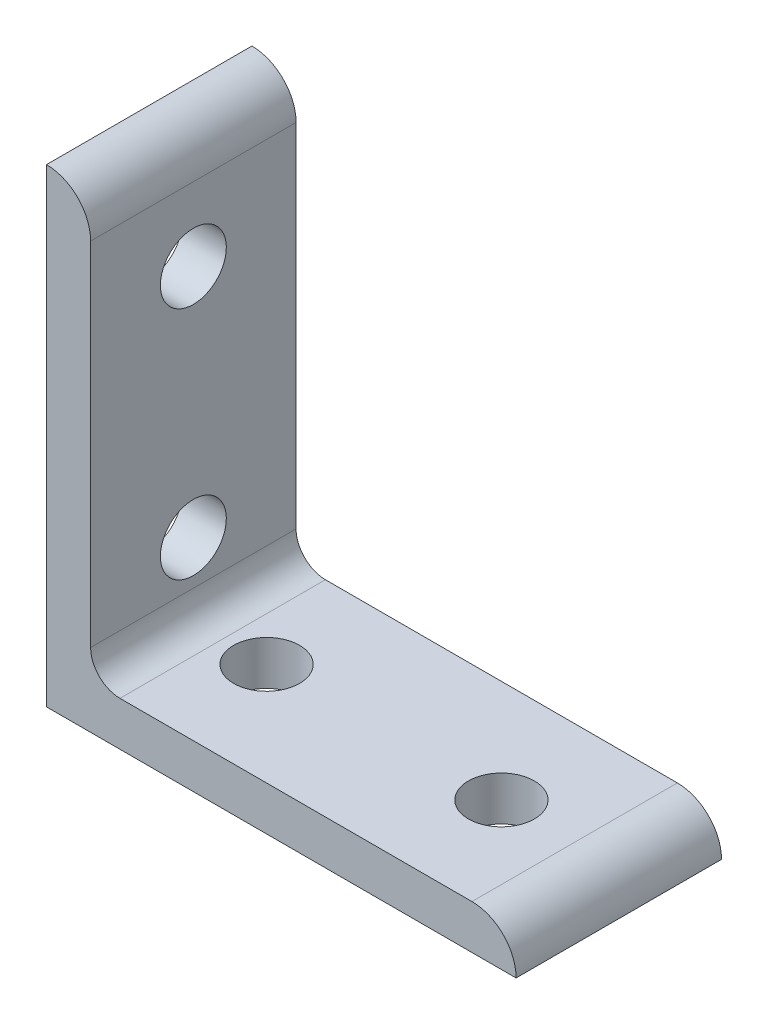
ISO-10303-21;
HEADER;
FILE_DESCRIPTION(('STEP AP214'),'2;1');
FILE_NAME('part.step','',(''),(''),'','','');
FILE_SCHEMA(('AUTOMOTIVE_DESIGN { 1 0 10303 214 1 1 1 1 }'));
ENDSEC;
DATA;
#1=APPLICATION_CONTEXT('core data for automotive mechanical design processes');
#2=APPLICATION_PROTOCOL_DEFINITION('international standard','automotive_design',2000,#1);
#3=PRODUCT_CONTEXT('',#1,'mechanical');
#4=PRODUCT('Part','Part','',(#3));
#5=PRODUCT_RELATED_PRODUCT_CATEGORY('part','',(#4));
#6=PRODUCT_DEFINITION_FORMATION('','',#4);
#7=PRODUCT_DEFINITION_CONTEXT('part definition',#1,'design');
#8=PRODUCT_DEFINITION('design','',#6,#7);
#9=PRODUCT_DEFINITION_SHAPE('','',#8);
#10=(LENGTH_UNIT() NAMED_UNIT(*) SI_UNIT(.MILLI.,.METRE.));
#11=(NAMED_UNIT(*) PLANE_ANGLE_UNIT() SI_UNIT($,.RADIAN.));
#12=(NAMED_UNIT(*) SI_UNIT($,.STERADIAN.) SOLID_ANGLE_UNIT());
#13=UNCERTAINTY_MEASURE_WITH_UNIT(LENGTH_MEASURE(1.E-05),#10,'distance_accuracy_value','');
#14=(GEOMETRIC_REPRESENTATION_CONTEXT(3) GLOBAL_UNCERTAINTY_ASSIGNED_CONTEXT((#13)) GLOBAL_UNIT_ASSIGNED_CONTEXT((#10,
#11,#12)) REPRESENTATION_CONTEXT('',''));
#15=CARTESIAN_POINT('',(0.,0.,0.));
#16=DIRECTION('',(0.,0.,1.));
#17=DIRECTION('',(1.,0.,0.));
#18=AXIS2_PLACEMENT_3D('',#15,#16,#17);
#19=CARTESIAN_POINT('',(4.7752,46.0248,11.1125));
#20=DIRECTION('',(-1.,0.,0.));
#21=DIRECTION('',(0.,-1.,0.));
#22=AXIS2_PLACEMENT_3D('',#19,#20,#21);
#23=PLANE('',#22);
#24=CARTESIAN_POINT('',(4.7752,12.7,0.));
#25=DIRECTION('',(-1.,0.,0.));
#26=DIRECTION('',(0.,-1.,0.));
#27=AXIS2_PLACEMENT_3D('',#24,#25,#26);
#28=CIRCLE('',#27,3.5687);
#29=CARTESIAN_POINT('',(4.7752,9.1313,0.));
#30=VERTEX_POINT('',#29);
#31=EDGE_CURVE('E211',#30,#30,#28,.F.);
#32=ORIENTED_EDGE('',*,*,#31,.F.);
#33=EDGE_LOOP('',(#32));
#34=FACE_BOUND('',#33,.T.);
#35=DIRECTION('',(0.,1.,0.));
#36=VECTOR('',#35,1.);
#37=CARTESIAN_POINT('',(4.7752,46.0248,-11.1125));
#38=LINE('',#37,#36);
#39=CARTESIAN_POINT('',(4.7752,7.9502,-11.1125));
#40=VERTEX_POINT('',#39);
#41=CARTESIAN_POINT('',(4.77519999999999,46.0248,-11.1125));
#42=VERTEX_POINT('',#41);
#43=EDGE_CURVE('E136',#40,#42,#38,.T.);
#44=ORIENTED_EDGE('',*,*,#43,.T.);
#45=DIRECTION('',(0.,0.,-1.));
#46=VECTOR('',#45,1.);
#47=CARTESIAN_POINT('',(4.77519999999999,46.0248,11.1125));
#48=LINE('',#47,#46);
#49=CARTESIAN_POINT('',(4.77519999999999,46.0248,11.1125));
#50=VERTEX_POINT('',#49);
#51=EDGE_CURVE('E133',#50,#42,#48,.T.);
#52=ORIENTED_EDGE('',*,*,#51,.F.);
#53=DIRECTION('',(0.,1.,0.));
#54=VECTOR('',#53,1.);
#55=CARTESIAN_POINT('',(4.7752,46.0248,11.1125));
#56=LINE('',#55,#54);
#57=CARTESIAN_POINT('',(4.7752,7.9502,11.1125));
#58=VERTEX_POINT('',#57);
#59=EDGE_CURVE('E121',#58,#50,#56,.T.);
#60=ORIENTED_EDGE('',*,*,#59,.F.);
#61=DIRECTION('',(0.,0.,-1.));
#62=VECTOR('',#61,1.);
#63=CARTESIAN_POINT('',(4.7752,7.9502,11.1125));
#64=LINE('',#63,#62);
#65=EDGE_CURVE('E138',#58,#40,#64,.T.);
#66=ORIENTED_EDGE('',*,*,#65,.T.);
#67=EDGE_LOOP('',(#44,#52,#60,#66));
#68=FACE_BOUND('',#67,.T.);
#69=CARTESIAN_POINT('',(4.77519999999999,38.1,0.));
#70=DIRECTION('',(-1.,0.,0.));
#71=DIRECTION('',(0.,-1.,0.));
#72=AXIS2_PLACEMENT_3D('',#69,#70,#71);
#73=CIRCLE('',#72,3.5687);
#74=CARTESIAN_POINT('',(4.77519999999999,34.5313,0.));
#75=VERTEX_POINT('',#74);
#76=EDGE_CURVE('E208',#75,#75,#73,.F.);
#77=ORIENTED_EDGE('',*,*,#76,.F.);
#78=EDGE_LOOP('',(#77));
#79=FACE_BOUND('',#78,.T.);
#80=ADVANCED_FACE('F38',(#34,#68,#79),#23,.F.);
#81=CARTESIAN_POINT('',(0.,0.,11.1125));
#82=DIRECTION('',(1.,0.,0.));
#83=DIRECTION('',(0.,0.,-1.));
#84=AXIS2_PLACEMENT_3D('',#81,#82,#83);
#85=PLANE('',#84);
#86=CARTESIAN_POINT('',(0.,12.7,0.));
#87=DIRECTION('',(1.,0.,0.));
#88=DIRECTION('',(0.,0.,-1.));
#89=AXIS2_PLACEMENT_3D('',#86,#87,#88);
#90=CIRCLE('',#89,3.5687);
#91=CARTESIAN_POINT('',(0.,12.7,-3.5687));
#92=VERTEX_POINT('',#91);
#93=EDGE_CURVE('E215',#92,#92,#90,.T.);
#94=ORIENTED_EDGE('',*,*,#93,.T.);
#95=EDGE_LOOP('',(#94));
#96=FACE_BOUND('',#95,.T.);
#97=DIRECTION('',(0.,-1.,0.));
#98=VECTOR('',#97,1.);
#99=CARTESIAN_POINT('',(0.,0.,-11.1125));
#100=LINE('',#99,#98);
#101=CARTESIAN_POINT('',(0.,50.8,-11.1125));
#102=VERTEX_POINT('',#101);
#103=CARTESIAN_POINT('',(0.,0.,-11.1125));
#104=VERTEX_POINT('',#103);
#105=EDGE_CURVE('E99',#102,#104,#100,.T.);
#106=ORIENTED_EDGE('',*,*,#105,.T.);
#107=DIRECTION('',(0.,0.,-1.));
#108=VECTOR('',#107,1.);
#109=CARTESIAN_POINT('',(0.,0.,11.1125));
#110=LINE('',#109,#108);
#111=CARTESIAN_POINT('',(0.,0.,11.1125));
#112=VERTEX_POINT('',#111);
#113=EDGE_CURVE('E145',#112,#104,#110,.T.);
#114=ORIENTED_EDGE('',*,*,#113,.F.);
#115=DIRECTION('',(0.,-1.,0.));
#116=VECTOR('',#115,1.);
#117=CARTESIAN_POINT('',(0.,0.,11.1125));
#118=LINE('',#117,#116);
#119=CARTESIAN_POINT('',(0.,50.8,11.1125));
#120=VERTEX_POINT('',#119);
#121=EDGE_CURVE('E58',#120,#112,#118,.T.);
#122=ORIENTED_EDGE('',*,*,#121,.F.);
#123=DIRECTION('',(0.,0.,-1.));
#124=VECTOR('',#123,1.);
#125=CARTESIAN_POINT('',(0.,50.8,11.1125));
#126=LINE('',#125,#124);
#127=EDGE_CURVE('E139',#120,#102,#126,.T.);
#128=ORIENTED_EDGE('',*,*,#127,.T.);
#129=EDGE_LOOP('',(#106,#114,#122,#128));
#130=FACE_BOUND('',#129,.T.);
#131=CARTESIAN_POINT('',(0.,38.1,0.));
#132=DIRECTION('',(1.,0.,0.));
#133=DIRECTION('',(0.,0.,-1.));
#134=AXIS2_PLACEMENT_3D('',#131,#132,#133);
#135=CIRCLE('',#134,3.5687);
#136=CARTESIAN_POINT('',(0.,38.1,-3.5687));
#137=VERTEX_POINT('',#136);
#138=EDGE_CURVE('E224',#137,#137,#135,.T.);
#139=ORIENTED_EDGE('',*,*,#138,.T.);
#140=EDGE_LOOP('',(#139));
#141=FACE_BOUND('',#140,.T.);
#142=ADVANCED_FACE('F228',(#96,#130,#141),#85,.F.);
#143=CARTESIAN_POINT('',(50.8,0.,11.1125));
#144=DIRECTION('',(0.,1.,0.));
#145=DIRECTION('',(-1.,0.,0.));
#146=AXIS2_PLACEMENT_3D('',#143,#144,#145);
#147=PLANE('',#146);
#148=CARTESIAN_POINT('',(12.7,0.,0.));
#149=DIRECTION('',(0.,1.,0.));
#150=DIRECTION('',(0.,0.,1.));
#151=AXIS2_PLACEMENT_3D('',#148,#149,#150);
#152=CIRCLE('',#151,3.5687);
#153=CARTESIAN_POINT('',(12.7,0.,3.5687));
#154=VERTEX_POINT('',#153);
#155=EDGE_CURVE('E184',#154,#154,#152,.T.);
#156=ORIENTED_EDGE('',*,*,#155,.T.);
#157=EDGE_LOOP('',(#156));
#158=FACE_BOUND('',#157,.T.);
#159=DIRECTION('',(1.,0.,0.));
#160=VECTOR('',#159,1.);
#161=CARTESIAN_POINT('',(50.8,0.,-11.1125));
#162=LINE('',#161,#160);
#163=CARTESIAN_POINT('',(50.8,0.,-11.1125));
#164=VERTEX_POINT('',#163);
#165=EDGE_CURVE('E149',#104,#164,#162,.T.);
#166=ORIENTED_EDGE('',*,*,#165,.T.);
#167=DIRECTION('',(0.,0.,-1.));
#168=VECTOR('',#167,1.);
#169=CARTESIAN_POINT('',(50.8,0.,11.1125));
#170=LINE('',#169,#168);
#171=CARTESIAN_POINT('',(50.8,0.,11.1125));
#172=VERTEX_POINT('',#171);
#173=EDGE_CURVE('E11',#172,#164,#170,.T.);
#174=ORIENTED_EDGE('',*,*,#173,.F.);
#175=DIRECTION('',(1.,0.,0.));
#176=VECTOR('',#175,1.);
#177=CARTESIAN_POINT('',(50.8,0.,11.1125));
#178=LINE('',#177,#176);
#179=EDGE_CURVE('E169',#112,#172,#178,.T.);
#180=ORIENTED_EDGE('',*,*,#179,.F.);
#181=ORIENTED_EDGE('',*,*,#113,.T.);
#182=EDGE_LOOP('',(#166,#174,#180,#181));
#183=FACE_BOUND('',#182,.T.);
#184=CARTESIAN_POINT('',(38.1,0.,0.));
#185=DIRECTION('',(0.,1.,0.));
#186=DIRECTION('',(0.,0.,1.));
#187=AXIS2_PLACEMENT_3D('',#184,#185,#186);
#188=CIRCLE('',#187,3.56869999999999);
#189=CARTESIAN_POINT('',(38.1,0.,3.56869999999999));
#190=VERTEX_POINT('',#189);
#191=EDGE_CURVE('E197',#190,#190,#188,.T.);
#192=ORIENTED_EDGE('',*,*,#191,.T.);
#193=EDGE_LOOP('',(#192));
#194=FACE_BOUND('',#193,.T.);
#195=ADVANCED_FACE('F40',(#158,#183,#194),#147,.F.);
#196=CARTESIAN_POINT('',(7.9502,4.7752,11.1125));
#197=DIRECTION('',(0.,-1.,0.));
#198=DIRECTION('',(1.,0.,0.));
#199=AXIS2_PLACEMENT_3D('',#196,#197,#198);
#200=PLANE('',#199);
#201=CARTESIAN_POINT('',(12.7,4.7752,0.));
#202=DIRECTION('',(0.,-1.,0.));
#203=DIRECTION('',(1.,0.,0.));
#204=AXIS2_PLACEMENT_3D('',#201,#202,#203);
#205=CIRCLE('',#204,3.5687);
#206=CARTESIAN_POINT('',(16.2687,4.7752,0.));
#207=VERTEX_POINT('',#206);
#208=EDGE_CURVE('E154',#207,#207,#205,.F.);
#209=ORIENTED_EDGE('',*,*,#208,.F.);
#210=EDGE_LOOP('',(#209));
#211=FACE_BOUND('',#210,.T.);
#212=DIRECTION('',(-1.,0.,0.));
#213=VECTOR('',#212,1.);
#214=CARTESIAN_POINT('',(7.9502,4.7752,-11.1125));
#215=LINE('',#214,#213);
#216=CARTESIAN_POINT('',(46.0248,4.7752,-11.1125));
#217=VERTEX_POINT('',#216);
#218=CARTESIAN_POINT('',(7.9502,4.7752,-11.1125));
#219=VERTEX_POINT('',#218);
#220=EDGE_CURVE('E157',#217,#219,#215,.T.);
#221=ORIENTED_EDGE('',*,*,#220,.T.);
#222=DIRECTION('',(0.,0.,-1.));
#223=VECTOR('',#222,1.);
#224=CARTESIAN_POINT('',(7.9502,4.7752,11.1125));
#225=LINE('',#224,#223);
#226=CARTESIAN_POINT('',(7.9502,4.7752,11.1125));
#227=VERTEX_POINT('',#226);
#228=EDGE_CURVE('E176',#227,#219,#225,.T.);
#229=ORIENTED_EDGE('',*,*,#228,.F.);
#230=DIRECTION('',(-1.,0.,0.));
#231=VECTOR('',#230,1.);
#232=CARTESIAN_POINT('',(7.9502,4.7752,11.1125));
#233=LINE('',#232,#231);
#234=CARTESIAN_POINT('',(46.0248,4.7752,11.1125));
#235=VERTEX_POINT('',#234);
#236=EDGE_CURVE('E204',#235,#227,#233,.T.);
#237=ORIENTED_EDGE('',*,*,#236,.F.);
#238=DIRECTION('',(0.,0.,-1.));
#239=VECTOR('',#238,1.);
#240=CARTESIAN_POINT('',(46.0248,4.7752,11.1125));
#241=LINE('',#240,#239);
#242=EDGE_CURVE('E49',#235,#217,#241,.T.);
#243=ORIENTED_EDGE('',*,*,#242,.T.);
#244=EDGE_LOOP('',(#221,#229,#237,#243));
#245=FACE_BOUND('',#244,.T.);
#246=CARTESIAN_POINT('',(38.1,4.7752,0.));
#247=DIRECTION('',(0.,-1.,0.));
#248=DIRECTION('',(1.,0.,0.));
#249=AXIS2_PLACEMENT_3D('',#246,#247,#248);
#250=CIRCLE('',#249,3.56869999999999);
#251=CARTESIAN_POINT('',(41.6687,4.7752,0.));
#252=VERTEX_POINT('',#251);
#253=EDGE_CURVE('E42',#252,#252,#250,.F.);
#254=ORIENTED_EDGE('',*,*,#253,.F.);
#255=EDGE_LOOP('',(#254));
#256=FACE_BOUND('',#255,.T.);
#257=ADVANCED_FACE('F251',(#211,#245,#256),#200,.F.);
#258=CARTESIAN_POINT('',(46.0248,0.,11.1125));
#259=DIRECTION('',(0.,0.,-1.));
#260=DIRECTION('',(-1.,0.,0.));
#261=AXIS2_PLACEMENT_3D('',#258,#259,#260);
#262=CYLINDRICAL_SURFACE('',#261,4.7752);
#263=CARTESIAN_POINT('',(46.0248,0.,-11.1125));
#264=DIRECTION('',(0.,0.,1.));
#265=DIRECTION('',(1.,0.,0.));
#266=AXIS2_PLACEMENT_3D('',#263,#264,#265);
#267=CIRCLE('',#266,4.7752);
#268=EDGE_CURVE('E153',#164,#217,#267,.T.);
#269=ORIENTED_EDGE('',*,*,#268,.T.);
#270=ORIENTED_EDGE('',*,*,#242,.F.);
#271=CARTESIAN_POINT('',(46.0248,0.,11.1125));
#272=DIRECTION('',(0.,0.,1.));
#273=DIRECTION('',(1.,0.,0.));
#274=AXIS2_PLACEMENT_3D('',#271,#272,#273);
#275=CIRCLE('',#274,4.7752);
#276=EDGE_CURVE('E109',#172,#235,#275,.T.);
#277=ORIENTED_EDGE('',*,*,#276,.F.);
#278=ORIENTED_EDGE('',*,*,#173,.T.);
#279=EDGE_LOOP('',(#269,#270,#277,#278));
#280=FACE_BOUND('',#279,.T.);
#281=ADVANCED_FACE('F249',(#280),#262,.T.);
#282=CARTESIAN_POINT('',(7.9502,7.9502,11.1125));
#283=DIRECTION('',(0.,0.,-1.));
#284=DIRECTION('',(-1.,0.,0.));
#285=AXIS2_PLACEMENT_3D('',#282,#283,#284);
#286=CYLINDRICAL_SURFACE('',#285,3.175);
#287=CARTESIAN_POINT('',(7.9502,7.9502,-11.1125));
#288=DIRECTION('',(0.,0.,-1.));
#289=DIRECTION('',(1.,0.,0.));
#290=AXIS2_PLACEMENT_3D('',#287,#288,#289);
#291=CIRCLE('',#290,3.175);
#292=EDGE_CURVE('E160',#219,#40,#291,.T.);
#293=ORIENTED_EDGE('',*,*,#292,.T.);
#294=ORIENTED_EDGE('',*,*,#65,.F.);
#295=CARTESIAN_POINT('',(7.9502,7.9502,11.1125));
#296=DIRECTION('',(0.,0.,-1.));
#297=DIRECTION('',(1.,0.,0.));
#298=AXIS2_PLACEMENT_3D('',#295,#296,#297);
#299=CIRCLE('',#298,3.175);
#300=EDGE_CURVE('E127',#227,#58,#299,.T.);
#301=ORIENTED_EDGE('',*,*,#300,.F.);
#302=ORIENTED_EDGE('',*,*,#228,.T.);
#303=EDGE_LOOP('',(#293,#294,#301,#302));
#304=FACE_BOUND('',#303,.T.);
#305=ADVANCED_FACE('F246',(#304),#286,.F.);
#306=CARTESIAN_POINT('',(0.,46.0248,11.1125));
#307=DIRECTION('',(0.,0.,-1.));
#308=DIRECTION('',(-1.,0.,0.));
#309=AXIS2_PLACEMENT_3D('',#306,#307,#308);
#310=CYLINDRICAL_SURFACE('',#309,4.77519999999999);
#311=CARTESIAN_POINT('',(0.,46.0248,-11.1125));
#312=DIRECTION('',(0.,0.,1.));
#313=DIRECTION('',(1.,0.,0.));
#314=AXIS2_PLACEMENT_3D('',#311,#312,#313);
#315=CIRCLE('',#314,4.77519999999999);
#316=EDGE_CURVE('E92',#42,#102,#315,.T.);
#317=ORIENTED_EDGE('',*,*,#316,.T.);
#318=ORIENTED_EDGE('',*,*,#127,.F.);
#319=CARTESIAN_POINT('',(0.,46.0248,11.1125));
#320=DIRECTION('',(0.,0.,1.));
#321=DIRECTION('',(1.,0.,0.));
#322=AXIS2_PLACEMENT_3D('',#319,#320,#321);
#323=CIRCLE('',#322,4.77519999999999);
#324=EDGE_CURVE('E125',#50,#120,#323,.T.);
#325=ORIENTED_EDGE('',*,*,#324,.F.);
#326=ORIENTED_EDGE('',*,*,#51,.T.);
#327=EDGE_LOOP('',(#317,#318,#325,#326));
#328=FACE_BOUND('',#327,.T.);
#329=ADVANCED_FACE('F141',(#328),#310,.T.);
#330=CARTESIAN_POINT('',(0.,46.0248,11.1125));
#331=DIRECTION('',(0.,0.,1.));
#332=DIRECTION('',(1.,0.,0.));
#333=AXIS2_PLACEMENT_3D('',#330,#331,#332);
#334=PLANE('',#333);
#335=ORIENTED_EDGE('',*,*,#179,.T.);
#336=ORIENTED_EDGE('',*,*,#276,.T.);
#337=ORIENTED_EDGE('',*,*,#236,.T.);
#338=ORIENTED_EDGE('',*,*,#300,.T.);
#339=ORIENTED_EDGE('',*,*,#59,.T.);
#340=ORIENTED_EDGE('',*,*,#324,.T.);
#341=ORIENTED_EDGE('',*,*,#121,.T.);
#342=EDGE_LOOP('',(#335,#336,#337,#338,#339,#340,#341));
#343=FACE_BOUND('',#342,.T.);
#344=ADVANCED_FACE('F123',(#343),#334,.T.);
#345=CARTESIAN_POINT('',(0.,46.0248,-11.1125));
#346=DIRECTION('',(0.,0.,1.));
#347=DIRECTION('',(1.,0.,0.));
#348=AXIS2_PLACEMENT_3D('',#345,#346,#347);
#349=PLANE('',#348);
#350=ORIENTED_EDGE('',*,*,#165,.F.);
#351=ORIENTED_EDGE('',*,*,#105,.F.);
#352=ORIENTED_EDGE('',*,*,#316,.F.);
#353=ORIENTED_EDGE('',*,*,#43,.F.);
#354=ORIENTED_EDGE('',*,*,#292,.F.);
#355=ORIENTED_EDGE('',*,*,#220,.F.);
#356=ORIENTED_EDGE('',*,*,#268,.F.);
#357=EDGE_LOOP('',(#350,#351,#352,#353,#354,#355,#356));
#358=FACE_BOUND('',#357,.T.);
#359=ADVANCED_FACE('F266',(#358),#349,.F.);
#360=CARTESIAN_POINT('',(12.7,50.8,0.));
#361=DIRECTION('',(0.,-1.,0.));
#362=DIRECTION('',(0.,0.,-1.));
#363=AXIS2_PLACEMENT_3D('',#360,#361,#362);
#364=CYLINDRICAL_SURFACE('',#363,3.5687);
#365=ORIENTED_EDGE('',*,*,#155,.F.);
#366=EDGE_LOOP('',(#365));
#367=FACE_BOUND('',#366,.T.);
#368=ORIENTED_EDGE('',*,*,#208,.T.);
#369=EDGE_LOOP('',(#368));
#370=FACE_BOUND('',#369,.T.);
#371=ADVANCED_FACE('F285',(#367,#370),#364,.F.);
#372=CARTESIAN_POINT('',(38.1,50.8,0.));
#373=DIRECTION('',(0.,-1.,0.));
#374=DIRECTION('',(0.,0.,-1.));
#375=AXIS2_PLACEMENT_3D('',#372,#373,#374);
#376=CYLINDRICAL_SURFACE('',#375,3.56869999999999);
#377=ORIENTED_EDGE('',*,*,#191,.F.);
#378=EDGE_LOOP('',(#377));
#379=FACE_BOUND('',#378,.T.);
#380=ORIENTED_EDGE('',*,*,#253,.T.);
#381=EDGE_LOOP('',(#380));
#382=FACE_BOUND('',#381,.T.);
#383=ADVANCED_FACE('F321',(#379,#382),#376,.F.);
#384=CARTESIAN_POINT('',(50.8,12.7,0.));
#385=DIRECTION('',(-1.,0.,0.));
#386=DIRECTION('',(0.,0.,1.));
#387=AXIS2_PLACEMENT_3D('',#384,#385,#386);
#388=CYLINDRICAL_SURFACE('',#387,3.5687);
#389=ORIENTED_EDGE('',*,*,#93,.F.);
#390=EDGE_LOOP('',(#389));
#391=FACE_BOUND('',#390,.T.);
#392=ORIENTED_EDGE('',*,*,#31,.T.);
#393=EDGE_LOOP('',(#392));
#394=FACE_BOUND('',#393,.T.);
#395=ADVANCED_FACE('F233',(#391,#394),#388,.F.);
#396=CARTESIAN_POINT('',(50.8,38.1,0.));
#397=DIRECTION('',(-1.,0.,0.));
#398=DIRECTION('',(0.,0.,1.));
#399=AXIS2_PLACEMENT_3D('',#396,#397,#398);
#400=CYLINDRICAL_SURFACE('',#399,3.5687);
#401=ORIENTED_EDGE('',*,*,#138,.F.);
#402=EDGE_LOOP('',(#401));
#403=FACE_BOUND('',#402,.T.);
#404=ORIENTED_EDGE('',*,*,#76,.T.);
#405=EDGE_LOOP('',(#404));
#406=FACE_BOUND('',#405,.T.);
#407=ADVANCED_FACE('F230',(#403,#406),#400,.F.);
#408=CLOSED_SHELL('',(#80,#142,#195,#257,#281,#305,#329,#344,#359,#371,#383,#395,#407));
#409=MANIFOLD_SOLID_BREP('B2',#408);
#410=ADVANCED_BREP_SHAPE_REPRESENTATION('',(#18,#409),#14);
#411=SHAPE_DEFINITION_REPRESENTATION(#9,#410);
ENDSEC;
END-ISO-10303-21;
